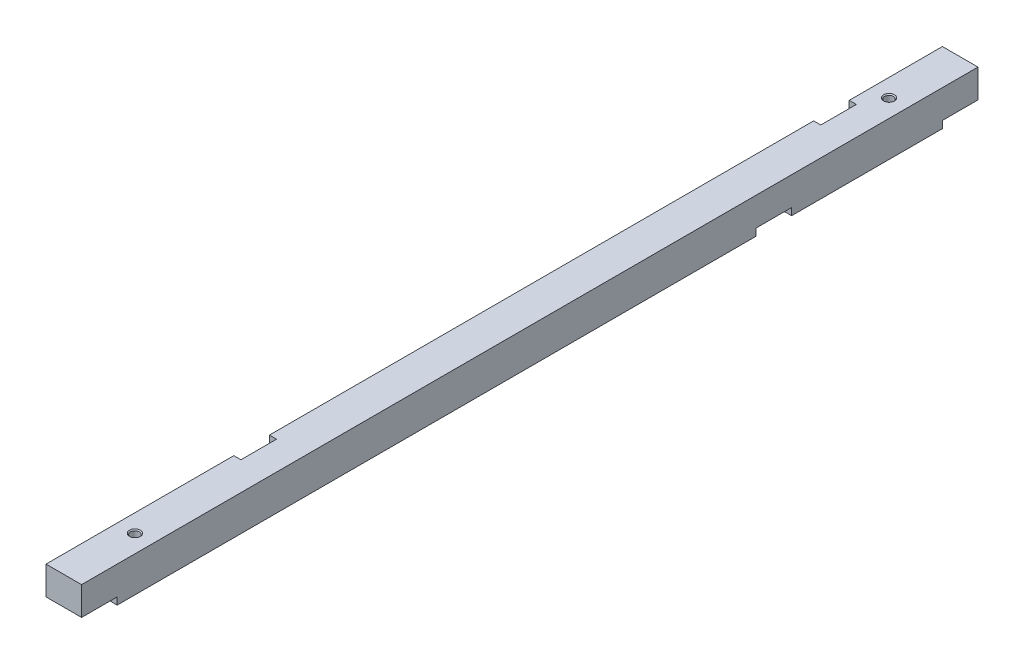
ISO-10303-21;
HEADER;
FILE_DESCRIPTION(('STEP AP214'),'2;1');
FILE_NAME('part.step','',(''),(''),'','','');
FILE_SCHEMA(('AUTOMOTIVE_DESIGN { 1 0 10303 214 1 1 1 1 }'));
ENDSEC;
DATA;
#1=APPLICATION_CONTEXT('core data for automotive mechanical design processes');
#2=APPLICATION_PROTOCOL_DEFINITION('international standard','automotive_design',2000,#1);
#3=PRODUCT_CONTEXT('',#1,'mechanical');
#4=PRODUCT('Part','Part','',(#3));
#5=PRODUCT_RELATED_PRODUCT_CATEGORY('part','',(#4));
#6=PRODUCT_DEFINITION_FORMATION('','',#4);
#7=PRODUCT_DEFINITION_CONTEXT('part definition',#1,'design');
#8=PRODUCT_DEFINITION('design','',#6,#7);
#9=PRODUCT_DEFINITION_SHAPE('','',#8);
#10=(LENGTH_UNIT() NAMED_UNIT(*) SI_UNIT(.MILLI.,.METRE.));
#11=(NAMED_UNIT(*) PLANE_ANGLE_UNIT() SI_UNIT($,.RADIAN.));
#12=(NAMED_UNIT(*) SI_UNIT($,.STERADIAN.) SOLID_ANGLE_UNIT());
#13=UNCERTAINTY_MEASURE_WITH_UNIT(LENGTH_MEASURE(1.E-05),#10,'distance_accuracy_value','');
#14=(GEOMETRIC_REPRESENTATION_CONTEXT(3) GLOBAL_UNCERTAINTY_ASSIGNED_CONTEXT((#13)) GLOBAL_UNIT_ASSIGNED_CONTEXT((#10,
#11,#12)) REPRESENTATION_CONTEXT('',''));
#15=CARTESIAN_POINT('',(0.,0.,0.));
#16=DIRECTION('',(0.,0.,1.));
#17=DIRECTION('',(1.,0.,0.));
#18=AXIS2_PLACEMENT_3D('',#15,#16,#17);
#19=CARTESIAN_POINT('',(-5.,5.,252.));
#20=DIRECTION('',(1.,0.,0.));
#21=DIRECTION('',(0.,1.,0.));
#22=AXIS2_PLACEMENT_3D('',#19,#20,#21);
#23=PLANE('',#22);
#24=DIRECTION('',(0.,0.,-1.));
#25=VECTOR('',#24,1.);
#26=CARTESIAN_POINT('',(-5.,-5.,252.));
#27=LINE('',#26,#25);
#28=CARTESIAN_POINT('',(-5.,-5.00000000000002,26.2));
#29=VERTEX_POINT('',#28);
#30=CARTESIAN_POINT('',(-5.,-5.00000000000001,10.));
#31=VERTEX_POINT('',#30);
#32=EDGE_CURVE('E44',#29,#31,#27,.T.);
#33=ORIENTED_EDGE('',*,*,#32,.F.);
#34=DIRECTION('',(0.,1.,0.));
#35=VECTOR('',#34,1.);
#36=CARTESIAN_POINT('',(-5.,-5.00000000000002,26.2));
#37=LINE('',#36,#35);
#38=CARTESIAN_POINT('',(-5.,5.,26.2));
#39=VERTEX_POINT('',#38);
#40=EDGE_CURVE('E307',#29,#39,#37,.T.);
#41=ORIENTED_EDGE('',*,*,#40,.T.);
#42=DIRECTION('',(0.,0.,-1.));
#43=VECTOR('',#42,1.);
#44=CARTESIAN_POINT('',(-5.,5.,252.));
#45=LINE('',#44,#43);
#46=CARTESIAN_POINT('',(-5.,5.,0.));
#47=VERTEX_POINT('',#46);
#48=EDGE_CURVE('E216',#39,#47,#45,.T.);
#49=ORIENTED_EDGE('',*,*,#48,.T.);
#50=DIRECTION('',(0.,-1.,0.));
#51=VECTOR('',#50,1.);
#52=CARTESIAN_POINT('',(-5.,5.,0.));
#53=LINE('',#52,#51);
#54=CARTESIAN_POINT('',(-5.,-3.,0.));
#55=VERTEX_POINT('',#54);
#56=EDGE_CURVE('E223',#47,#55,#53,.T.);
#57=ORIENTED_EDGE('',*,*,#56,.T.);
#58=DIRECTION('',(0.,0.,-1.));
#59=VECTOR('',#58,1.);
#60=CARTESIAN_POINT('',(-5.,-3.,0.));
#61=LINE('',#60,#59);
#62=CARTESIAN_POINT('',(-5.,-3.,10.));
#63=VERTEX_POINT('',#62);
#64=EDGE_CURVE('E240',#63,#55,#61,.T.);
#65=ORIENTED_EDGE('',*,*,#64,.F.);
#66=DIRECTION('',(0.,1.,0.));
#67=VECTOR('',#66,1.);
#68=CARTESIAN_POINT('',(-5.,-5.00000000000001,10.));
#69=LINE('',#68,#67);
#70=EDGE_CURVE('E243',#31,#63,#69,.T.);
#71=ORIENTED_EDGE('',*,*,#70,.F.);
#72=EDGE_LOOP('',(#33,#41,#49,#57,#65,#71));
#73=FACE_BOUND('',#72,.T.);
#74=ADVANCED_FACE('F35',(#73),#23,.F.);
#75=CARTESIAN_POINT('',(-5.,5.,189.2));
#76=VERTEX_POINT('',#75);
#77=CARTESIAN_POINT('',(-5.,5.,36.2));
#78=VERTEX_POINT('',#77);
#79=EDGE_CURVE('E191',#76,#78,#45,.T.);
#80=ORIENTED_EDGE('',*,*,#79,.T.);
#81=DIRECTION('',(0.,1.,0.));
#82=VECTOR('',#81,1.);
#83=CARTESIAN_POINT('',(-5.,-5.00000000000002,36.2));
#84=LINE('',#83,#82);
#85=CARTESIAN_POINT('',(-5.,-5.00000000000002,36.2));
#86=VERTEX_POINT('',#85);
#87=EDGE_CURVE('E52',#86,#78,#84,.T.);
#88=ORIENTED_EDGE('',*,*,#87,.F.);
#89=CARTESIAN_POINT('',(-5.,-5.00000000000001,52.3999999999999));
#90=VERTEX_POINT('',#89);
#91=EDGE_CURVE('E45',#90,#86,#27,.T.);
#92=ORIENTED_EDGE('',*,*,#91,.F.);
#93=DIRECTION('',(0.,-1.,0.));
#94=VECTOR('',#93,1.);
#95=CARTESIAN_POINT('',(-5.,-5.00000000000001,52.3999999999999));
#96=LINE('',#95,#94);
#97=CARTESIAN_POINT('',(-5.,-3.,52.3999999999999));
#98=VERTEX_POINT('',#97);
#99=EDGE_CURVE('E266',#98,#90,#96,.T.);
#100=ORIENTED_EDGE('',*,*,#99,.F.);
#101=DIRECTION('',(0.,0.,-1.));
#102=VECTOR('',#101,1.);
#103=CARTESIAN_POINT('',(-5.,-3.,52.3999999999999));
#104=LINE('',#103,#102);
#105=CARTESIAN_POINT('',(-5.,-3.,62.4));
#106=VERTEX_POINT('',#105);
#107=EDGE_CURVE('E259',#106,#98,#104,.T.);
#108=ORIENTED_EDGE('',*,*,#107,.F.);
#109=DIRECTION('',(0.,1.,0.));
#110=VECTOR('',#109,1.);
#111=CARTESIAN_POINT('',(-5.,-5.00000000000001,62.4));
#112=LINE('',#111,#110);
#113=CARTESIAN_POINT('',(-5.,-5.00000000000001,62.4));
#114=VERTEX_POINT('',#113);
#115=EDGE_CURVE('E263',#114,#106,#112,.T.);
#116=ORIENTED_EDGE('',*,*,#115,.F.);
#117=CARTESIAN_POINT('',(-5.,-5.00000000000002,189.2));
#118=VERTEX_POINT('',#117);
#119=EDGE_CURVE('E43',#118,#114,#27,.T.);
#120=ORIENTED_EDGE('',*,*,#119,.F.);
#121=DIRECTION('',(0.,1.,0.));
#122=VECTOR('',#121,1.);
#123=CARTESIAN_POINT('',(-5.,-5.00000000000002,189.2));
#124=LINE('',#123,#122);
#125=EDGE_CURVE('E288',#118,#76,#124,.T.);
#126=ORIENTED_EDGE('',*,*,#125,.T.);
#127=EDGE_LOOP('',(#80,#88,#92,#100,#108,#116,#120,#126));
#128=FACE_BOUND('',#127,.T.);
#129=ADVANCED_FACE('F187',(#128),#23,.F.);
#130=CARTESIAN_POINT('',(-5.,-5.,252.));
#131=DIRECTION('',(0.,1.,0.));
#132=DIRECTION('',(0.,0.,1.));
#133=AXIS2_PLACEMENT_3D('',#130,#131,#132);
#134=PLANE('',#133);
#135=CARTESIAN_POINT('',(0.,-5.00000000000002,20.));
#136=DIRECTION('',(0.,1.,0.));
#137=DIRECTION('',(0.,0.,1.));
#138=AXIS2_PLACEMENT_3D('',#135,#136,#137);
#139=CIRCLE('',#138,1.25);
#140=CARTESIAN_POINT('',(0.,-5.00000000000002,21.25));
#141=VERTEX_POINT('',#140);
#142=EDGE_CURVE('E337',#141,#141,#139,.T.);
#143=ORIENTED_EDGE('',*,*,#142,.T.);
#144=EDGE_LOOP('',(#143));
#145=FACE_BOUND('',#144,.T.);
#146=DIRECTION('',(0.,0.,-1.));
#147=VECTOR('',#146,1.);
#148=CARTESIAN_POINT('',(-3.,-5.00000000000002,36.2));
#149=LINE('',#148,#147);
#150=CARTESIAN_POINT('',(-3.,-5.00000000000002,36.2));
#151=VERTEX_POINT('',#150);
#152=CARTESIAN_POINT('',(-3.,-5.00000000000002,26.2));
#153=VERTEX_POINT('',#152);
#154=EDGE_CURVE('E181',#151,#153,#149,.T.);
#155=ORIENTED_EDGE('',*,*,#154,.T.);
#156=DIRECTION('',(-1.,0.,0.));
#157=VECTOR('',#156,1.);
#158=CARTESIAN_POINT('',(-5.,-5.00000000000002,26.2));
#159=LINE('',#158,#157);
#160=EDGE_CURVE('E192',#153,#29,#159,.T.);
#161=ORIENTED_EDGE('',*,*,#160,.T.);
#162=ORIENTED_EDGE('',*,*,#32,.T.);
#163=DIRECTION('',(-1.,0.,0.));
#164=VECTOR('',#163,1.);
#165=CARTESIAN_POINT('',(5.,-5.,10.));
#166=LINE('',#165,#164);
#167=CARTESIAN_POINT('',(5.,-5.,10.));
#168=VERTEX_POINT('',#167);
#169=EDGE_CURVE('E233',#168,#31,#166,.T.);
#170=ORIENTED_EDGE('',*,*,#169,.F.);
#171=DIRECTION('',(0.,0.,-1.));
#172=VECTOR('',#171,1.);
#173=CARTESIAN_POINT('',(5.,-5.,252.));
#174=LINE('',#173,#172);
#175=CARTESIAN_POINT('',(5.,-5.,52.3999999999999));
#176=VERTEX_POINT('',#175);
#177=EDGE_CURVE('E203',#176,#168,#174,.T.);
#178=ORIENTED_EDGE('',*,*,#177,.F.);
#179=DIRECTION('',(-1.,0.,0.));
#180=VECTOR('',#179,1.);
#181=CARTESIAN_POINT('',(5.,-5.,52.3999999999999));
#182=LINE('',#181,#180);
#183=EDGE_CURVE('E197',#176,#90,#182,.T.);
#184=ORIENTED_EDGE('',*,*,#183,.T.);
#185=ORIENTED_EDGE('',*,*,#91,.T.);
#186=DIRECTION('',(1.,0.,0.));
#187=VECTOR('',#186,1.);
#188=CARTESIAN_POINT('',(-5.,-5.00000000000002,36.2));
#189=LINE('',#188,#187);
#190=EDGE_CURVE('E174',#86,#151,#189,.T.);
#191=ORIENTED_EDGE('',*,*,#190,.T.);
#192=EDGE_LOOP('',(#155,#161,#162,#170,#178,#184,#185,#191));
#193=FACE_BOUND('',#192,.T.);
#194=ADVANCED_FACE('F195',(#145,#193),#134,.F.);
#195=CARTESIAN_POINT('',(-5.,5.,252.));
#196=VERTEX_POINT('',#195);
#197=CARTESIAN_POINT('',(-5.,5.,199.2));
#198=VERTEX_POINT('',#197);
#199=EDGE_CURVE('E213',#196,#198,#45,.T.);
#200=ORIENTED_EDGE('',*,*,#199,.T.);
#201=DIRECTION('',(0.,1.,0.));
#202=VECTOR('',#201,1.);
#203=CARTESIAN_POINT('',(-5.,-5.00000000000002,199.2));
#204=LINE('',#203,#202);
#205=CARTESIAN_POINT('',(-5.,-5.00000000000002,199.2));
#206=VERTEX_POINT('',#205);
#207=EDGE_CURVE('E60',#206,#198,#204,.T.);
#208=ORIENTED_EDGE('',*,*,#207,.F.);
#209=CARTESIAN_POINT('',(-5.,-5.00000000000002,242.));
#210=VERTEX_POINT('',#209);
#211=EDGE_CURVE('E11',#210,#206,#27,.T.);
#212=ORIENTED_EDGE('',*,*,#211,.F.);
#213=DIRECTION('',(0.,-1.,0.));
#214=VECTOR('',#213,1.);
#215=CARTESIAN_POINT('',(-5.,-5.00000000000002,242.));
#216=LINE('',#215,#214);
#217=CARTESIAN_POINT('',(-5.,-3.,242.));
#218=VERTEX_POINT('',#217);
#219=EDGE_CURVE('E286',#218,#210,#216,.T.);
#220=ORIENTED_EDGE('',*,*,#219,.F.);
#221=DIRECTION('',(0.,0.,-1.));
#222=VECTOR('',#221,1.);
#223=CARTESIAN_POINT('',(-5.,-3.,242.));
#224=LINE('',#223,#222);
#225=CARTESIAN_POINT('',(-5.,-3.,252.));
#226=VERTEX_POINT('',#225);
#227=EDGE_CURVE('E282',#226,#218,#224,.T.);
#228=ORIENTED_EDGE('',*,*,#227,.F.);
#229=DIRECTION('',(0.,-1.,0.));
#230=VECTOR('',#229,1.);
#231=CARTESIAN_POINT('',(-5.,5.,252.));
#232=LINE('',#231,#230);
#233=EDGE_CURVE('E220',#196,#226,#232,.T.);
#234=ORIENTED_EDGE('',*,*,#233,.F.);
#235=EDGE_LOOP('',(#200,#208,#212,#220,#228,#234));
#236=FACE_BOUND('',#235,.T.);
#237=ADVANCED_FACE('F37',(#236),#23,.F.);
#238=CARTESIAN_POINT('',(0.,-5.00000000000002,232.));
#239=DIRECTION('',(0.,1.,0.));
#240=DIRECTION('',(0.,0.,1.));
#241=AXIS2_PLACEMENT_3D('',#238,#239,#240);
#242=CIRCLE('',#241,1.25);
#243=CARTESIAN_POINT('',(0.,-5.00000000000002,233.25));
#244=VERTEX_POINT('',#243);
#245=EDGE_CURVE('E326',#244,#244,#242,.T.);
#246=ORIENTED_EDGE('',*,*,#245,.T.);
#247=EDGE_LOOP('',(#246));
#248=FACE_BOUND('',#247,.T.);
#249=DIRECTION('',(0.,0.,-1.));
#250=VECTOR('',#249,1.);
#251=CARTESIAN_POINT('',(-3.,-5.00000000000002,199.2));
#252=LINE('',#251,#250);
#253=CARTESIAN_POINT('',(-3.,-5.00000000000002,199.2));
#254=VERTEX_POINT('',#253);
#255=CARTESIAN_POINT('',(-3.,-5.00000000000002,189.2));
#256=VERTEX_POINT('',#255);
#257=EDGE_CURVE('E310',#254,#256,#252,.T.);
#258=ORIENTED_EDGE('',*,*,#257,.T.);
#259=DIRECTION('',(-1.,0.,0.));
#260=VECTOR('',#259,1.);
#261=CARTESIAN_POINT('',(-5.,-5.00000000000002,189.2));
#262=LINE('',#261,#260);
#263=EDGE_CURVE('E294',#256,#118,#262,.T.);
#264=ORIENTED_EDGE('',*,*,#263,.T.);
#265=ORIENTED_EDGE('',*,*,#119,.T.);
#266=DIRECTION('',(-1.,0.,0.));
#267=VECTOR('',#266,1.);
#268=CARTESIAN_POINT('',(5.,-5.,62.4));
#269=LINE('',#268,#267);
#270=CARTESIAN_POINT('',(5.,-5.,62.4));
#271=VERTEX_POINT('',#270);
#272=EDGE_CURVE('E252',#271,#114,#269,.T.);
#273=ORIENTED_EDGE('',*,*,#272,.F.);
#274=CARTESIAN_POINT('',(5.,-5.00000000000002,242.));
#275=VERTEX_POINT('',#274);
#276=EDGE_CURVE('E198',#275,#271,#174,.T.);
#277=ORIENTED_EDGE('',*,*,#276,.F.);
#278=DIRECTION('',(-1.,0.,0.));
#279=VECTOR('',#278,1.);
#280=CARTESIAN_POINT('',(5.,-5.00000000000002,242.));
#281=LINE('',#280,#279);
#282=EDGE_CURVE('E275',#275,#210,#281,.T.);
#283=ORIENTED_EDGE('',*,*,#282,.T.);
#284=ORIENTED_EDGE('',*,*,#211,.T.);
#285=DIRECTION('',(1.,0.,0.));
#286=VECTOR('',#285,1.);
#287=CARTESIAN_POINT('',(-5.,-5.00000000000002,199.2));
#288=LINE('',#287,#286);
#289=EDGE_CURVE('E301',#206,#254,#288,.T.);
#290=ORIENTED_EDGE('',*,*,#289,.T.);
#291=EDGE_LOOP('',(#258,#264,#265,#273,#277,#283,#284,#290));
#292=FACE_BOUND('',#291,.T.);
#293=ADVANCED_FACE('F380',(#248,#292),#134,.F.);
#294=CARTESIAN_POINT('',(5.,5.,252.));
#295=DIRECTION('',(-1.,0.,0.));
#296=DIRECTION('',(0.,-1.,0.));
#297=AXIS2_PLACEMENT_3D('',#294,#295,#296);
#298=PLANE('',#297);
#299=DIRECTION('',(0.,0.,-1.));
#300=VECTOR('',#299,1.);
#301=CARTESIAN_POINT('',(5.,-3.,242.));
#302=LINE('',#301,#300);
#303=CARTESIAN_POINT('',(5.,-3.,252.));
#304=VERTEX_POINT('',#303);
#305=CARTESIAN_POINT('',(5.,-3.,242.));
#306=VERTEX_POINT('',#305);
#307=EDGE_CURVE('E279',#304,#306,#302,.T.);
#308=ORIENTED_EDGE('',*,*,#307,.T.);
#309=DIRECTION('',(0.,-1.,0.));
#310=VECTOR('',#309,1.);
#311=CARTESIAN_POINT('',(5.,-5.00000000000002,242.));
#312=LINE('',#311,#310);
#313=EDGE_CURVE('E285',#306,#275,#312,.T.);
#314=ORIENTED_EDGE('',*,*,#313,.T.);
#315=ORIENTED_EDGE('',*,*,#276,.T.);
#316=DIRECTION('',(0.,1.,0.));
#317=VECTOR('',#316,1.);
#318=CARTESIAN_POINT('',(5.,-5.,62.4));
#319=LINE('',#318,#317);
#320=CARTESIAN_POINT('',(5.,-3.,62.4));
#321=VERTEX_POINT('',#320);
#322=EDGE_CURVE('E271',#271,#321,#319,.T.);
#323=ORIENTED_EDGE('',*,*,#322,.T.);
#324=DIRECTION('',(0.,0.,-1.));
#325=VECTOR('',#324,1.);
#326=CARTESIAN_POINT('',(5.,-3.,52.3999999999999));
#327=LINE('',#326,#325);
#328=CARTESIAN_POINT('',(5.,-3.,52.3999999999999));
#329=VERTEX_POINT('',#328);
#330=EDGE_CURVE('E253',#321,#329,#327,.T.);
#331=ORIENTED_EDGE('',*,*,#330,.T.);
#332=DIRECTION('',(0.,-1.,0.));
#333=VECTOR('',#332,1.);
#334=CARTESIAN_POINT('',(5.,-5.,52.3999999999999));
#335=LINE('',#334,#333);
#336=EDGE_CURVE('E262',#329,#176,#335,.T.);
#337=ORIENTED_EDGE('',*,*,#336,.T.);
#338=ORIENTED_EDGE('',*,*,#177,.T.);
#339=DIRECTION('',(0.,1.,0.));
#340=VECTOR('',#339,1.);
#341=CARTESIAN_POINT('',(5.,-5.,10.));
#342=LINE('',#341,#340);
#343=CARTESIAN_POINT('',(5.,-3.,10.));
#344=VERTEX_POINT('',#343);
#345=EDGE_CURVE('E242',#168,#344,#342,.T.);
#346=ORIENTED_EDGE('',*,*,#345,.T.);
#347=DIRECTION('',(0.,0.,-1.));
#348=VECTOR('',#347,1.);
#349=CARTESIAN_POINT('',(5.,-3.,0.));
#350=LINE('',#349,#348);
#351=CARTESIAN_POINT('',(5.,-3.,0.));
#352=VERTEX_POINT('',#351);
#353=EDGE_CURVE('E236',#344,#352,#350,.T.);
#354=ORIENTED_EDGE('',*,*,#353,.T.);
#355=DIRECTION('',(0.,1.,0.));
#356=VECTOR('',#355,1.);
#357=CARTESIAN_POINT('',(5.,5.,0.));
#358=LINE('',#357,#356);
#359=CARTESIAN_POINT('',(5.,5.,0.));
#360=VERTEX_POINT('',#359);
#361=EDGE_CURVE('E221',#352,#360,#358,.T.);
#362=ORIENTED_EDGE('',*,*,#361,.T.);
#363=DIRECTION('',(0.,0.,-1.));
#364=VECTOR('',#363,1.);
#365=CARTESIAN_POINT('',(5.,5.,252.));
#366=LINE('',#365,#364);
#367=CARTESIAN_POINT('',(5.,5.,252.));
#368=VERTEX_POINT('',#367);
#369=EDGE_CURVE('E209',#368,#360,#366,.T.);
#370=ORIENTED_EDGE('',*,*,#369,.F.);
#371=DIRECTION('',(0.,1.,0.));
#372=VECTOR('',#371,1.);
#373=CARTESIAN_POINT('',(5.,5.,252.));
#374=LINE('',#373,#372);
#375=EDGE_CURVE('E229',#304,#368,#374,.T.);
#376=ORIENTED_EDGE('',*,*,#375,.F.);
#377=EDGE_LOOP('',(#308,#314,#315,#323,#331,#337,#338,#346,#354,#362,#370,#376));
#378=FACE_BOUND('',#377,.T.);
#379=ADVANCED_FACE('F353',(#378),#298,.F.);
#380=CARTESIAN_POINT('',(-5.,5.,252.));
#381=DIRECTION('',(0.,-1.,0.));
#382=DIRECTION('',(0.,0.,-1.));
#383=AXIS2_PLACEMENT_3D('',#380,#381,#382);
#384=PLANE('',#383);
#385=CARTESIAN_POINT('',(0.,5.,20.));
#386=DIRECTION('',(0.,1.,0.));
#387=DIRECTION('',(0.,0.,1.));
#388=AXIS2_PLACEMENT_3D('',#385,#386,#387);
#389=CIRCLE('',#388,1.525);
#390=CARTESIAN_POINT('',(0.,5.,21.525));
#391=VERTEX_POINT('',#390);
#392=EDGE_CURVE('E343',#391,#391,#389,.T.);
#393=ORIENTED_EDGE('',*,*,#392,.F.);
#394=EDGE_LOOP('',(#393));
#395=FACE_BOUND('',#394,.T.);
#396=CARTESIAN_POINT('',(0.,5.,232.));
#397=DIRECTION('',(0.,1.,0.));
#398=DIRECTION('',(0.,0.,1.));
#399=AXIS2_PLACEMENT_3D('',#396,#397,#398);
#400=CIRCLE('',#399,1.525);
#401=CARTESIAN_POINT('',(0.,5.,233.525));
#402=VERTEX_POINT('',#401);
#403=EDGE_CURVE('E334',#402,#402,#400,.T.);
#404=ORIENTED_EDGE('',*,*,#403,.F.);
#405=EDGE_LOOP('',(#404));
#406=FACE_BOUND('',#405,.T.);
#407=ORIENTED_EDGE('',*,*,#48,.F.);
#408=DIRECTION('',(-1.,0.,0.));
#409=VECTOR('',#408,1.);
#410=CARTESIAN_POINT('',(-5.,5.,26.2));
#411=LINE('',#410,#409);
#412=CARTESIAN_POINT('',(-3.,5.,26.2));
#413=VERTEX_POINT('',#412);
#414=EDGE_CURVE('E182',#413,#39,#411,.T.);
#415=ORIENTED_EDGE('',*,*,#414,.F.);
#416=DIRECTION('',(0.,0.,-1.));
#417=VECTOR('',#416,1.);
#418=CARTESIAN_POINT('',(-3.,5.,36.2));
#419=LINE('',#418,#417);
#420=CARTESIAN_POINT('',(-3.,5.,36.2));
#421=VERTEX_POINT('',#420);
#422=EDGE_CURVE('E321',#421,#413,#419,.T.);
#423=ORIENTED_EDGE('',*,*,#422,.F.);
#424=DIRECTION('',(1.,0.,0.));
#425=VECTOR('',#424,1.);
#426=CARTESIAN_POINT('',(-5.,5.,36.2));
#427=LINE('',#426,#425);
#428=EDGE_CURVE('E324',#78,#421,#427,.T.);
#429=ORIENTED_EDGE('',*,*,#428,.F.);
#430=ORIENTED_EDGE('',*,*,#79,.F.);
#431=DIRECTION('',(-1.,0.,0.));
#432=VECTOR('',#431,1.);
#433=CARTESIAN_POINT('',(-5.,5.,189.2));
#434=LINE('',#433,#432);
#435=CARTESIAN_POINT('',(-3.,5.,189.2));
#436=VERTEX_POINT('',#435);
#437=EDGE_CURVE('E299',#436,#76,#434,.T.);
#438=ORIENTED_EDGE('',*,*,#437,.F.);
#439=DIRECTION('',(0.,0.,-1.));
#440=VECTOR('',#439,1.);
#441=CARTESIAN_POINT('',(-3.,5.,199.2));
#442=LINE('',#441,#440);
#443=CARTESIAN_POINT('',(-3.,5.,199.2));
#444=VERTEX_POINT('',#443);
#445=EDGE_CURVE('E302',#444,#436,#442,.T.);
#446=ORIENTED_EDGE('',*,*,#445,.F.);
#447=DIRECTION('',(1.,0.,0.));
#448=VECTOR('',#447,1.);
#449=CARTESIAN_POINT('',(-5.,5.,199.2));
#450=LINE('',#449,#448);
#451=EDGE_CURVE('E305',#198,#444,#450,.T.);
#452=ORIENTED_EDGE('',*,*,#451,.F.);
#453=ORIENTED_EDGE('',*,*,#199,.F.);
#454=DIRECTION('',(-1.,0.,0.));
#455=VECTOR('',#454,1.);
#456=CARTESIAN_POINT('',(-5.,5.,252.));
#457=LINE('',#456,#455);
#458=EDGE_CURVE('E227',#368,#196,#457,.T.);
#459=ORIENTED_EDGE('',*,*,#458,.F.);
#460=ORIENTED_EDGE('',*,*,#369,.T.);
#461=DIRECTION('',(-1.,0.,0.));
#462=VECTOR('',#461,1.);
#463=CARTESIAN_POINT('',(-5.,5.,0.));
#464=LINE('',#463,#462);
#465=EDGE_CURVE('E217',#360,#47,#464,.T.);
#466=ORIENTED_EDGE('',*,*,#465,.T.);
#467=EDGE_LOOP('',(#407,#415,#423,#429,#430,#438,#446,#452,#453,#459,#460,#466));
#468=FACE_BOUND('',#467,.T.);
#469=ADVANCED_FACE('F349',(#395,#406,#468),#384,.F.);
#470=CARTESIAN_POINT('',(0.,0.,252.));
#471=DIRECTION('',(0.,0.,1.));
#472=DIRECTION('',(1.,0.,0.));
#473=AXIS2_PLACEMENT_3D('',#470,#471,#472);
#474=PLANE('',#473);
#475=DIRECTION('',(-1.,0.,0.));
#476=VECTOR('',#475,1.);
#477=CARTESIAN_POINT('',(5.,-3.,252.));
#478=LINE('',#477,#476);
#479=EDGE_CURVE('E278',#304,#226,#478,.T.);
#480=ORIENTED_EDGE('',*,*,#479,.F.);
#481=ORIENTED_EDGE('',*,*,#375,.T.);
#482=ORIENTED_EDGE('',*,*,#458,.T.);
#483=ORIENTED_EDGE('',*,*,#233,.T.);
#484=EDGE_LOOP('',(#480,#481,#482,#483));
#485=FACE_BOUND('',#484,.T.);
#486=ADVANCED_FACE('F352',(#485),#474,.T.);
#487=CARTESIAN_POINT('',(0.,0.,0.));
#488=DIRECTION('',(0.,0.,1.));
#489=DIRECTION('',(1.,0.,0.));
#490=AXIS2_PLACEMENT_3D('',#487,#488,#489);
#491=PLANE('',#490);
#492=ORIENTED_EDGE('',*,*,#361,.F.);
#493=DIRECTION('',(-1.,0.,0.));
#494=VECTOR('',#493,1.);
#495=CARTESIAN_POINT('',(5.,-3.,0.));
#496=LINE('',#495,#494);
#497=EDGE_CURVE('E226',#352,#55,#496,.T.);
#498=ORIENTED_EDGE('',*,*,#497,.T.);
#499=ORIENTED_EDGE('',*,*,#56,.F.);
#500=ORIENTED_EDGE('',*,*,#465,.F.);
#501=EDGE_LOOP('',(#492,#498,#499,#500));
#502=FACE_BOUND('',#501,.T.);
#503=ADVANCED_FACE('F435',(#502),#491,.F.);
#504=CARTESIAN_POINT('',(5.,-3.,0.));
#505=DIRECTION('',(0.,1.,0.));
#506=DIRECTION('',(-1.,0.,0.));
#507=AXIS2_PLACEMENT_3D('',#504,#505,#506);
#508=PLANE('',#507);
#509=ORIENTED_EDGE('',*,*,#64,.T.);
#510=ORIENTED_EDGE('',*,*,#497,.F.);
#511=ORIENTED_EDGE('',*,*,#353,.F.);
#512=DIRECTION('',(-1.,0.,0.));
#513=VECTOR('',#512,1.);
#514=CARTESIAN_POINT('',(5.,-3.,10.));
#515=LINE('',#514,#513);
#516=EDGE_CURVE('E235',#344,#63,#515,.T.);
#517=ORIENTED_EDGE('',*,*,#516,.T.);
#518=EDGE_LOOP('',(#509,#510,#511,#517));
#519=FACE_BOUND('',#518,.T.);
#520=ADVANCED_FACE('F397',(#519),#508,.F.);
#521=CARTESIAN_POINT('',(5.,-5.,10.));
#522=DIRECTION('',(0.,0.,1.));
#523=DIRECTION('',(1.,0.,0.));
#524=AXIS2_PLACEMENT_3D('',#521,#522,#523);
#525=PLANE('',#524);
#526=ORIENTED_EDGE('',*,*,#70,.T.);
#527=ORIENTED_EDGE('',*,*,#516,.F.);
#528=ORIENTED_EDGE('',*,*,#345,.F.);
#529=ORIENTED_EDGE('',*,*,#169,.T.);
#530=EDGE_LOOP('',(#526,#527,#528,#529));
#531=FACE_BOUND('',#530,.T.);
#532=ADVANCED_FACE('F390',(#531),#525,.F.);
#533=CARTESIAN_POINT('',(5.,-5.,52.3999999999999));
#534=DIRECTION('',(0.,0.,-1.));
#535=DIRECTION('',(-1.,0.,0.));
#536=AXIS2_PLACEMENT_3D('',#533,#534,#535);
#537=PLANE('',#536);
#538=ORIENTED_EDGE('',*,*,#99,.T.);
#539=ORIENTED_EDGE('',*,*,#183,.F.);
#540=ORIENTED_EDGE('',*,*,#336,.F.);
#541=DIRECTION('',(-1.,0.,0.));
#542=VECTOR('',#541,1.);
#543=CARTESIAN_POINT('',(5.,-3.,52.3999999999999));
#544=LINE('',#543,#542);
#545=EDGE_CURVE('E246',#329,#98,#544,.T.);
#546=ORIENTED_EDGE('',*,*,#545,.T.);
#547=EDGE_LOOP('',(#538,#539,#540,#546));
#548=FACE_BOUND('',#547,.T.);
#549=ADVANCED_FACE('F388',(#548),#537,.F.);
#550=CARTESIAN_POINT('',(5.,-3.,52.3999999999999));
#551=DIRECTION('',(0.,1.,0.));
#552=DIRECTION('',(-1.,0.,0.));
#553=AXIS2_PLACEMENT_3D('',#550,#551,#552);
#554=PLANE('',#553);
#555=ORIENTED_EDGE('',*,*,#107,.T.);
#556=ORIENTED_EDGE('',*,*,#545,.F.);
#557=ORIENTED_EDGE('',*,*,#330,.F.);
#558=DIRECTION('',(-1.,0.,0.));
#559=VECTOR('',#558,1.);
#560=CARTESIAN_POINT('',(5.,-3.,62.4));
#561=LINE('',#560,#559);
#562=EDGE_CURVE('E256',#321,#106,#561,.T.);
#563=ORIENTED_EDGE('',*,*,#562,.T.);
#564=EDGE_LOOP('',(#555,#556,#557,#563));
#565=FACE_BOUND('',#564,.T.);
#566=ADVANCED_FACE('F386',(#565),#554,.F.);
#567=CARTESIAN_POINT('',(5.,-5.,62.4));
#568=DIRECTION('',(0.,0.,1.));
#569=DIRECTION('',(1.,0.,0.));
#570=AXIS2_PLACEMENT_3D('',#567,#568,#569);
#571=PLANE('',#570);
#572=ORIENTED_EDGE('',*,*,#115,.T.);
#573=ORIENTED_EDGE('',*,*,#562,.F.);
#574=ORIENTED_EDGE('',*,*,#322,.F.);
#575=ORIENTED_EDGE('',*,*,#272,.T.);
#576=EDGE_LOOP('',(#572,#573,#574,#575));
#577=FACE_BOUND('',#576,.T.);
#578=ADVANCED_FACE('F382',(#577),#571,.F.);
#579=CARTESIAN_POINT('',(5.,-5.00000000000002,242.));
#580=DIRECTION('',(0.,0.,-1.));
#581=DIRECTION('',(-1.,0.,0.));
#582=AXIS2_PLACEMENT_3D('',#579,#580,#581);
#583=PLANE('',#582);
#584=ORIENTED_EDGE('',*,*,#219,.T.);
#585=ORIENTED_EDGE('',*,*,#282,.F.);
#586=ORIENTED_EDGE('',*,*,#313,.F.);
#587=DIRECTION('',(-1.,0.,0.));
#588=VECTOR('',#587,1.);
#589=CARTESIAN_POINT('',(5.,-3.,242.));
#590=LINE('',#589,#588);
#591=EDGE_CURVE('E268',#306,#218,#590,.T.);
#592=ORIENTED_EDGE('',*,*,#591,.T.);
#593=EDGE_LOOP('',(#584,#585,#586,#592));
#594=FACE_BOUND('',#593,.T.);
#595=ADVANCED_FACE('F425',(#594),#583,.F.);
#596=CARTESIAN_POINT('',(5.,-3.,242.));
#597=DIRECTION('',(0.,1.,0.));
#598=DIRECTION('',(-1.,0.,0.));
#599=AXIS2_PLACEMENT_3D('',#596,#597,#598);
#600=PLANE('',#599);
#601=ORIENTED_EDGE('',*,*,#227,.T.);
#602=ORIENTED_EDGE('',*,*,#591,.F.);
#603=ORIENTED_EDGE('',*,*,#307,.F.);
#604=ORIENTED_EDGE('',*,*,#479,.T.);
#605=EDGE_LOOP('',(#601,#602,#603,#604));
#606=FACE_BOUND('',#605,.T.);
#607=ADVANCED_FACE('F428',(#606),#600,.F.);
#608=CARTESIAN_POINT('',(-5.,-5.00000000000002,189.2));
#609=DIRECTION('',(0.,0.,-1.));
#610=DIRECTION('',(-1.,0.,0.));
#611=AXIS2_PLACEMENT_3D('',#608,#609,#610);
#612=PLANE('',#611);
#613=ORIENTED_EDGE('',*,*,#437,.T.);
#614=ORIENTED_EDGE('',*,*,#125,.F.);
#615=ORIENTED_EDGE('',*,*,#263,.F.);
#616=DIRECTION('',(0.,1.,0.));
#617=VECTOR('',#616,1.);
#618=CARTESIAN_POINT('',(-3.,-5.00000000000002,189.2));
#619=LINE('',#618,#617);
#620=EDGE_CURVE('E296',#256,#436,#619,.T.);
#621=ORIENTED_EDGE('',*,*,#620,.T.);
#622=EDGE_LOOP('',(#613,#614,#615,#621));
#623=FACE_BOUND('',#622,.T.);
#624=ADVANCED_FACE('F373',(#623),#612,.F.);
#625=CARTESIAN_POINT('',(-3.,-5.00000000000002,199.2));
#626=DIRECTION('',(1.,0.,0.));
#627=DIRECTION('',(0.,0.,-1.));
#628=AXIS2_PLACEMENT_3D('',#625,#626,#627);
#629=PLANE('',#628);
#630=ORIENTED_EDGE('',*,*,#445,.T.);
#631=ORIENTED_EDGE('',*,*,#620,.F.);
#632=ORIENTED_EDGE('',*,*,#257,.F.);
#633=DIRECTION('',(0.,1.,0.));
#634=VECTOR('',#633,1.);
#635=CARTESIAN_POINT('',(-3.,-5.00000000000002,199.2));
#636=LINE('',#635,#634);
#637=EDGE_CURVE('E293',#254,#444,#636,.T.);
#638=ORIENTED_EDGE('',*,*,#637,.T.);
#639=EDGE_LOOP('',(#630,#631,#632,#638));
#640=FACE_BOUND('',#639,.T.);
#641=ADVANCED_FACE('F422',(#640),#629,.F.);
#642=CARTESIAN_POINT('',(-5.,-5.00000000000002,199.2));
#643=DIRECTION('',(0.,0.,1.));
#644=DIRECTION('',(1.,0.,0.));
#645=AXIS2_PLACEMENT_3D('',#642,#643,#644);
#646=PLANE('',#645);
#647=ORIENTED_EDGE('',*,*,#451,.T.);
#648=ORIENTED_EDGE('',*,*,#637,.F.);
#649=ORIENTED_EDGE('',*,*,#289,.F.);
#650=ORIENTED_EDGE('',*,*,#207,.T.);
#651=EDGE_LOOP('',(#647,#648,#649,#650));
#652=FACE_BOUND('',#651,.T.);
#653=ADVANCED_FACE('F419',(#652),#646,.F.);
#654=CARTESIAN_POINT('',(-5.,-5.00000000000002,26.2));
#655=DIRECTION('',(0.,0.,-1.));
#656=DIRECTION('',(-1.,0.,0.));
#657=AXIS2_PLACEMENT_3D('',#654,#655,#656);
#658=PLANE('',#657);
#659=ORIENTED_EDGE('',*,*,#414,.T.);
#660=ORIENTED_EDGE('',*,*,#40,.F.);
#661=ORIENTED_EDGE('',*,*,#160,.F.);
#662=DIRECTION('',(0.,1.,0.));
#663=VECTOR('',#662,1.);
#664=CARTESIAN_POINT('',(-3.,-5.00000000000002,26.2));
#665=LINE('',#664,#663);
#666=EDGE_CURVE('E316',#153,#413,#665,.T.);
#667=ORIENTED_EDGE('',*,*,#666,.T.);
#668=EDGE_LOOP('',(#659,#660,#661,#667));
#669=FACE_BOUND('',#668,.T.);
#670=ADVANCED_FACE('F367',(#669),#658,.F.);
#671=CARTESIAN_POINT('',(-3.,-5.00000000000002,36.2));
#672=DIRECTION('',(1.,0.,0.));
#673=DIRECTION('',(0.,0.,-1.));
#674=AXIS2_PLACEMENT_3D('',#671,#672,#673);
#675=PLANE('',#674);
#676=ORIENTED_EDGE('',*,*,#422,.T.);
#677=ORIENTED_EDGE('',*,*,#666,.F.);
#678=ORIENTED_EDGE('',*,*,#154,.F.);
#679=DIRECTION('',(0.,1.,0.));
#680=VECTOR('',#679,1.);
#681=CARTESIAN_POINT('',(-3.,-5.00000000000002,36.2));
#682=LINE('',#681,#680);
#683=EDGE_CURVE('E176',#151,#421,#682,.T.);
#684=ORIENTED_EDGE('',*,*,#683,.T.);
#685=EDGE_LOOP('',(#676,#677,#678,#684));
#686=FACE_BOUND('',#685,.T.);
#687=ADVANCED_FACE('F369',(#686),#675,.F.);
#688=CARTESIAN_POINT('',(-5.,-5.00000000000002,36.2));
#689=DIRECTION('',(0.,0.,1.));
#690=DIRECTION('',(1.,0.,0.));
#691=AXIS2_PLACEMENT_3D('',#688,#689,#690);
#692=PLANE('',#691);
#693=ORIENTED_EDGE('',*,*,#428,.T.);
#694=ORIENTED_EDGE('',*,*,#683,.F.);
#695=ORIENTED_EDGE('',*,*,#190,.F.);
#696=ORIENTED_EDGE('',*,*,#87,.T.);
#697=EDGE_LOOP('',(#693,#694,#695,#696));
#698=FACE_BOUND('',#697,.T.);
#699=ADVANCED_FACE('F175',(#698),#692,.F.);
#700=CARTESIAN_POINT('',(0.,5.,232.));
#701=DIRECTION('',(0.,1.,0.));
#702=DIRECTION('',(0.,0.,1.));
#703=AXIS2_PLACEMENT_3D('',#700,#701,#702);
#704=CYLINDRICAL_SURFACE('',#703,1.24999999999999);
#705=ORIENTED_EDGE('',*,*,#245,.F.);
#706=EDGE_LOOP('',(#705));
#707=FACE_BOUND('',#706,.T.);
#708=CARTESIAN_POINT('',(0.,4.72499999999999,232.));
#709=DIRECTION('',(0.,1.,0.));
#710=DIRECTION('',(0.,0.,1.));
#711=AXIS2_PLACEMENT_3D('',#708,#709,#710);
#712=CIRCLE('',#711,1.24999999999999);
#713=CARTESIAN_POINT('',(0.,4.72499999999999,233.25));
#714=VERTEX_POINT('',#713);
#715=EDGE_CURVE('E331',#714,#714,#712,.T.);
#716=ORIENTED_EDGE('',*,*,#715,.T.);
#717=EDGE_LOOP('',(#716));
#718=FACE_BOUND('',#717,.T.);
#719=ADVANCED_FACE('F573',(#707,#718),#704,.F.);
#720=CARTESIAN_POINT('',(0.,5.,232.));
#721=DIRECTION('',(0.,1.,0.));
#722=DIRECTION('',(0.,0.,1.));
#723=AXIS2_PLACEMENT_3D('',#720,#721,#722);
#724=CONICAL_SURFACE('',#723,1.525,0.785398163397448);
#725=ORIENTED_EDGE('',*,*,#715,.F.);
#726=EDGE_LOOP('',(#725));
#727=FACE_BOUND('',#726,.T.);
#728=ORIENTED_EDGE('',*,*,#403,.T.);
#729=EDGE_LOOP('',(#728));
#730=FACE_BOUND('',#729,.T.);
#731=ADVANCED_FACE('F596',(#727,#730),#724,.F.);
#732=CARTESIAN_POINT('',(0.,5.,20.));
#733=DIRECTION('',(0.,1.,0.));
#734=DIRECTION('',(0.,0.,1.));
#735=AXIS2_PLACEMENT_3D('',#732,#733,#734);
#736=CYLINDRICAL_SURFACE('',#735,1.24999999999999);
#737=ORIENTED_EDGE('',*,*,#142,.F.);
#738=EDGE_LOOP('',(#737));
#739=FACE_BOUND('',#738,.T.);
#740=CARTESIAN_POINT('',(0.,4.72499999999999,20.));
#741=DIRECTION('',(0.,1.,0.));
#742=DIRECTION('',(0.,0.,1.));
#743=AXIS2_PLACEMENT_3D('',#740,#741,#742);
#744=CIRCLE('',#743,1.24999999999999);
#745=CARTESIAN_POINT('',(0.,4.72499999999999,21.25));
#746=VERTEX_POINT('',#745);
#747=EDGE_CURVE('E340',#746,#746,#744,.T.);
#748=ORIENTED_EDGE('',*,*,#747,.T.);
#749=EDGE_LOOP('',(#748));
#750=FACE_BOUND('',#749,.T.);
#751=ADVANCED_FACE('F604',(#739,#750),#736,.F.);
#752=CARTESIAN_POINT('',(0.,5.,20.));
#753=DIRECTION('',(0.,1.,0.));
#754=DIRECTION('',(0.,0.,1.));
#755=AXIS2_PLACEMENT_3D('',#752,#753,#754);
#756=CONICAL_SURFACE('',#755,1.525,0.785398163397448);
#757=ORIENTED_EDGE('',*,*,#747,.F.);
#758=EDGE_LOOP('',(#757));
#759=FACE_BOUND('',#758,.T.);
#760=ORIENTED_EDGE('',*,*,#392,.T.);
#761=EDGE_LOOP('',(#760));
#762=FACE_BOUND('',#761,.T.);
#763=ADVANCED_FACE('F347',(#759,#762),#756,.F.);
#764=CLOSED_SHELL('',(#74,#129,#194,#237,#293,#379,#469,#486,#503,#520,#532,#549,#566,#578,#595,
#607,#624,#641,#653,#670,#687,#699,#719,#731,#751,#763));
#765=MANIFOLD_SOLID_BREP('B2',#764);
#766=ADVANCED_BREP_SHAPE_REPRESENTATION('',(#18,#765),#14);
#767=SHAPE_DEFINITION_REPRESENTATION(#9,#766);
ENDSEC;
END-ISO-10303-21;
